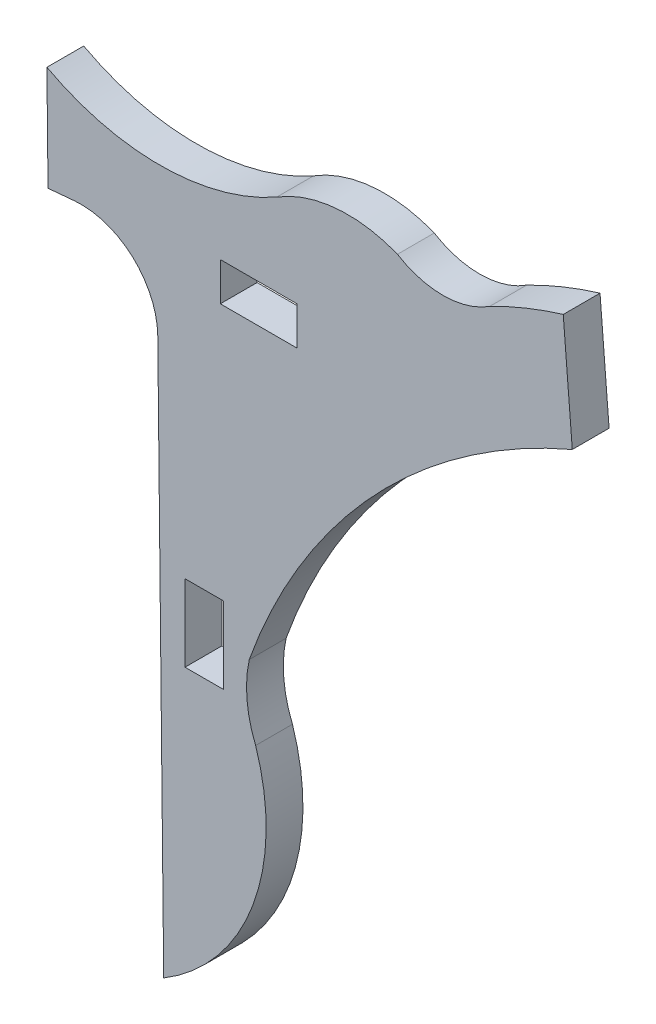
ISO-10303-21;
HEADER;
FILE_DESCRIPTION(('STEP AP214'),'2;1');
FILE_NAME('part.step','',(''),(''),'','','');
FILE_SCHEMA(('AUTOMOTIVE_DESIGN { 1 0 10303 214 1 1 1 1 }'));
ENDSEC;
DATA;
#1=APPLICATION_CONTEXT('core data for automotive mechanical design processes');
#2=APPLICATION_PROTOCOL_DEFINITION('international standard','automotive_design',2000,#1);
#3=PRODUCT_CONTEXT('',#1,'mechanical');
#4=PRODUCT('Part','Part','',(#3));
#5=PRODUCT_RELATED_PRODUCT_CATEGORY('part','',(#4));
#6=PRODUCT_DEFINITION_FORMATION('','',#4);
#7=PRODUCT_DEFINITION_CONTEXT('part definition',#1,'design');
#8=PRODUCT_DEFINITION('design','',#6,#7);
#9=PRODUCT_DEFINITION_SHAPE('','',#8);
#10=(LENGTH_UNIT() NAMED_UNIT(*) SI_UNIT(.MILLI.,.METRE.));
#11=(NAMED_UNIT(*) PLANE_ANGLE_UNIT() SI_UNIT($,.RADIAN.));
#12=(NAMED_UNIT(*) SI_UNIT($,.STERADIAN.) SOLID_ANGLE_UNIT());
#13=UNCERTAINTY_MEASURE_WITH_UNIT(LENGTH_MEASURE(1.E-05),#10,'distance_accuracy_value','');
#14=(GEOMETRIC_REPRESENTATION_CONTEXT(3) GLOBAL_UNCERTAINTY_ASSIGNED_CONTEXT((#13)) GLOBAL_UNIT_ASSIGNED_CONTEXT((#10,
#11,#12)) REPRESENTATION_CONTEXT('',''));
#15=CARTESIAN_POINT('',(0.,0.,0.));
#16=DIRECTION('',(0.,0.,1.));
#17=DIRECTION('',(1.,0.,0.));
#18=AXIS2_PLACEMENT_3D('',#15,#16,#17);
#19=CARTESIAN_POINT('',(0.,51.7881294098823,1.524));
#20=DIRECTION('',(0.,-1.,0.));
#21=DIRECTION('',(0.,0.,-1.));
#22=AXIS2_PLACEMENT_3D('',#19,#20,#21);
#23=PLANE('',#22);
#24=DIRECTION('',(-1.,0.,0.));
#25=VECTOR('',#24,1.);
#26=CARTESIAN_POINT('',(0.,51.7881294098823,0.));
#27=LINE('',#26,#25);
#28=CARTESIAN_POINT('',(-93.5356901838483,51.7881294098823,0.));
#29=VERTEX_POINT('',#28);
#30=CARTESIAN_POINT('',(-95.1231901838483,51.7881294098823,0.));
#31=VERTEX_POINT('',#30);
#32=EDGE_CURVE('E249',#29,#31,#27,.T.);
#33=ORIENTED_EDGE('',*,*,#32,.T.);
#34=DIRECTION('',(0.,0.,-1.));
#35=VECTOR('',#34,1.);
#36=CARTESIAN_POINT('',(-95.1231901838483,51.7881294098823,1.524));
#37=LINE('',#36,#35);
#38=CARTESIAN_POINT('',(-95.1231901838483,51.7881294098823,1.524));
#39=VERTEX_POINT('',#38);
#40=EDGE_CURVE('E11',#39,#31,#37,.T.);
#41=ORIENTED_EDGE('',*,*,#40,.F.);
#42=DIRECTION('',(-1.,0.,0.));
#43=VECTOR('',#42,1.);
#44=CARTESIAN_POINT('',(0.,51.7881294098823,1.524));
#45=LINE('',#44,#43);
#46=CARTESIAN_POINT('',(-93.5356901838483,51.7881294098823,1.524));
#47=VERTEX_POINT('',#46);
#48=EDGE_CURVE('E187',#47,#39,#45,.T.);
#49=ORIENTED_EDGE('',*,*,#48,.F.);
#50=DIRECTION('',(0.,0.,-1.));
#51=VECTOR('',#50,1.);
#52=CARTESIAN_POINT('',(-93.5356901838483,51.7881294098823,1.524));
#53=LINE('',#52,#51);
#54=EDGE_CURVE('E256',#47,#29,#53,.T.);
#55=ORIENTED_EDGE('',*,*,#54,.T.);
#56=EDGE_LOOP('',(#33,#41,#49,#55));
#57=FACE_BOUND('',#56,.T.);
#58=ADVANCED_FACE('F34',(#57),#23,.F.);
#59=CARTESIAN_POINT('',(-95.1231901838485,4.15779354007507E-13,1.524));
#60=DIRECTION('',(-1.,0.,0.));
#61=DIRECTION('',(0.,-1.,0.));
#62=AXIS2_PLACEMENT_3D('',#59,#60,#61);
#63=PLANE('',#62);
#64=DIRECTION('',(0.,1.,0.));
#65=VECTOR('',#64,1.);
#66=CARTESIAN_POINT('',(-95.1231901838485,4.15779354007507E-13,0.));
#67=LINE('',#66,#65);
#68=CARTESIAN_POINT('',(-95.1231901838483,54.9631294098823,0.));
#69=VERTEX_POINT('',#68);
#70=EDGE_CURVE('E192',#31,#69,#67,.T.);
#71=ORIENTED_EDGE('',*,*,#70,.T.);
#72=DIRECTION('',(0.,0.,-1.));
#73=VECTOR('',#72,1.);
#74=CARTESIAN_POINT('',(-95.1231901838483,54.9631294098823,1.524));
#75=LINE('',#74,#73);
#76=CARTESIAN_POINT('',(-95.1231901838483,54.9631294098823,1.524));
#77=VERTEX_POINT('',#76);
#78=EDGE_CURVE('E44',#77,#69,#75,.T.);
#79=ORIENTED_EDGE('',*,*,#78,.F.);
#80=DIRECTION('',(0.,1.,0.));
#81=VECTOR('',#80,1.);
#82=CARTESIAN_POINT('',(-95.1231901838485,4.15779354007507E-13,1.524));
#83=LINE('',#82,#81);
#84=EDGE_CURVE('E181',#39,#77,#83,.T.);
#85=ORIENTED_EDGE('',*,*,#84,.F.);
#86=ORIENTED_EDGE('',*,*,#40,.T.);
#87=EDGE_LOOP('',(#71,#79,#85,#86));
#88=FACE_BOUND('',#87,.T.);
#89=ADVANCED_FACE('F191',(#88),#63,.F.);
#90=CARTESIAN_POINT('',(0.,54.9631294098823,1.524));
#91=DIRECTION('',(0.,1.,0.));
#92=DIRECTION('',(0.,0.,1.));
#93=AXIS2_PLACEMENT_3D('',#90,#91,#92);
#94=PLANE('',#93);
#95=DIRECTION('',(1.,0.,0.));
#96=VECTOR('',#95,1.);
#97=CARTESIAN_POINT('',(0.,54.9631294098823,0.));
#98=LINE('',#97,#96);
#99=CARTESIAN_POINT('',(-93.5356901838483,54.9631294098823,0.));
#100=VERTEX_POINT('',#99);
#101=EDGE_CURVE('E118',#69,#100,#98,.T.);
#102=ORIENTED_EDGE('',*,*,#101,.T.);
#103=DIRECTION('',(0.,0.,-1.));
#104=VECTOR('',#103,1.);
#105=CARTESIAN_POINT('',(-93.5356901838483,54.9631294098823,1.524));
#106=LINE('',#105,#104);
#107=CARTESIAN_POINT('',(-93.5356901838483,54.9631294098823,1.524));
#108=VERTEX_POINT('',#107);
#109=EDGE_CURVE('E193',#108,#100,#106,.T.);
#110=ORIENTED_EDGE('',*,*,#109,.F.);
#111=DIRECTION('',(1.,0.,0.));
#112=VECTOR('',#111,1.);
#113=CARTESIAN_POINT('',(0.,54.9631294098823,1.524));
#114=LINE('',#113,#112);
#115=EDGE_CURVE('E185',#77,#108,#114,.T.);
#116=ORIENTED_EDGE('',*,*,#115,.F.);
#117=ORIENTED_EDGE('',*,*,#78,.T.);
#118=EDGE_LOOP('',(#102,#110,#116,#117));
#119=FACE_BOUND('',#118,.T.);
#120=ADVANCED_FACE('F195',(#119),#94,.F.);
#121=CARTESIAN_POINT('',(0.,65.550965331908,1.524));
#122=DIRECTION('',(0.,1.,0.));
#123=DIRECTION('',(0.,0.,1.));
#124=AXIS2_PLACEMENT_3D('',#121,#122,#123);
#125=PLANE('',#124);
#126=DIRECTION('',(1.,0.,0.));
#127=VECTOR('',#126,1.);
#128=CARTESIAN_POINT('',(0.,65.550965331908,0.));
#129=LINE('',#128,#127);
#130=CARTESIAN_POINT('',(-93.6606975148635,65.550965331908,0.));
#131=VERTEX_POINT('',#130);
#132=CARTESIAN_POINT('',(-90.4856975148635,65.550965331908,0.));
#133=VERTEX_POINT('',#132);
#134=EDGE_CURVE('E237',#131,#133,#129,.T.);
#135=ORIENTED_EDGE('',*,*,#134,.F.);
#136=DIRECTION('',(0.,0.,-1.));
#137=VECTOR('',#136,1.);
#138=CARTESIAN_POINT('',(-93.6606975148635,65.550965331908,1.524));
#139=LINE('',#138,#137);
#140=CARTESIAN_POINT('',(-93.6606975148635,65.550965331908,1.524));
#141=VERTEX_POINT('',#140);
#142=EDGE_CURVE('E258',#141,#131,#139,.T.);
#143=ORIENTED_EDGE('',*,*,#142,.F.);
#144=DIRECTION('',(1.,0.,0.));
#145=VECTOR('',#144,1.);
#146=CARTESIAN_POINT('',(0.,65.550965331908,1.524));
#147=LINE('',#146,#145);
#148=CARTESIAN_POINT('',(-90.4856975148635,65.550965331908,1.524));
#149=VERTEX_POINT('',#148);
#150=EDGE_CURVE('E339',#141,#149,#147,.T.);
#151=ORIENTED_EDGE('',*,*,#150,.T.);
#152=DIRECTION('',(0.,0.,-1.));
#153=VECTOR('',#152,1.);
#154=CARTESIAN_POINT('',(-90.4856975148635,65.550965331908,1.524));
#155=LINE('',#154,#153);
#156=EDGE_CURVE('E260',#149,#133,#155,.T.);
#157=ORIENTED_EDGE('',*,*,#156,.T.);
#158=EDGE_LOOP('',(#135,#143,#151,#157));
#159=FACE_BOUND('',#158,.T.);
#160=ADVANCED_FACE('F364',(#159),#125,.T.);
#161=CARTESIAN_POINT('',(-93.6606975148641,8.18773723491756E-13,1.524));
#162=DIRECTION('',(1.,0.,0.));
#163=DIRECTION('',(0.,1.,0.));
#164=AXIS2_PLACEMENT_3D('',#161,#162,#163);
#165=PLANE('',#164);
#166=DIRECTION('',(0.,-1.,0.));
#167=VECTOR('',#166,1.);
#168=CARTESIAN_POINT('',(-93.6606975148641,8.18773723491756E-13,0.));
#169=LINE('',#168,#167);
#170=CARTESIAN_POINT('',(-93.6606975148635,67.138465331908,0.));
#171=VERTEX_POINT('',#170);
#172=EDGE_CURVE('E240',#171,#131,#169,.T.);
#173=ORIENTED_EDGE('',*,*,#172,.F.);
#174=DIRECTION('',(0.,0.,-1.));
#175=VECTOR('',#174,1.);
#176=CARTESIAN_POINT('',(-93.6606975148635,67.138465331908,1.524));
#177=LINE('',#176,#175);
#178=CARTESIAN_POINT('',(-93.6606975148635,67.138465331908,1.524));
#179=VERTEX_POINT('',#178);
#180=EDGE_CURVE('E264',#179,#171,#177,.T.);
#181=ORIENTED_EDGE('',*,*,#180,.F.);
#182=DIRECTION('',(0.,-1.,0.));
#183=VECTOR('',#182,1.);
#184=CARTESIAN_POINT('',(-93.6606975148641,8.18773723491756E-13,1.524));
#185=LINE('',#184,#183);
#186=EDGE_CURVE('E342',#179,#141,#185,.T.);
#187=ORIENTED_EDGE('',*,*,#186,.T.);
#188=ORIENTED_EDGE('',*,*,#142,.T.);
#189=EDGE_LOOP('',(#173,#181,#187,#188));
#190=FACE_BOUND('',#189,.T.);
#191=ADVANCED_FACE('F366',(#190),#165,.T.);
#192=CARTESIAN_POINT('',(0.,67.138465331908,1.524));
#193=DIRECTION('',(0.,-1.,0.));
#194=DIRECTION('',(0.,0.,-1.));
#195=AXIS2_PLACEMENT_3D('',#192,#193,#194);
#196=PLANE('',#195);
#197=DIRECTION('',(-1.,0.,0.));
#198=VECTOR('',#197,1.);
#199=CARTESIAN_POINT('',(0.,67.138465331908,0.));
#200=LINE('',#199,#198);
#201=CARTESIAN_POINT('',(-90.4856975148635,67.138465331908,0.));
#202=VERTEX_POINT('',#201);
#203=EDGE_CURVE('E243',#202,#171,#200,.T.);
#204=ORIENTED_EDGE('',*,*,#203,.F.);
#205=DIRECTION('',(0.,0.,-1.));
#206=VECTOR('',#205,1.);
#207=CARTESIAN_POINT('',(-90.4856975148635,67.138465331908,1.524));
#208=LINE('',#207,#206);
#209=CARTESIAN_POINT('',(-90.4856975148635,67.138465331908,1.524));
#210=VERTEX_POINT('',#209);
#211=EDGE_CURVE('E262',#210,#202,#208,.T.);
#212=ORIENTED_EDGE('',*,*,#211,.F.);
#213=DIRECTION('',(-1.,0.,0.));
#214=VECTOR('',#213,1.);
#215=CARTESIAN_POINT('',(0.,67.138465331908,1.524));
#216=LINE('',#215,#214);
#217=EDGE_CURVE('E345',#210,#179,#216,.T.);
#218=ORIENTED_EDGE('',*,*,#217,.T.);
#219=ORIENTED_EDGE('',*,*,#180,.T.);
#220=EDGE_LOOP('',(#204,#212,#218,#219));
#221=FACE_BOUND('',#220,.T.);
#222=ADVANCED_FACE('F359',(#221),#196,.T.);
#223=CARTESIAN_POINT('',(-100.533781239061,47.7146855529903,1.524));
#224=DIRECTION('',(0.,0.,-1.));
#225=DIRECTION('',(-1.,0.,0.));
#226=AXIS2_PLACEMENT_3D('',#223,#224,#225);
#227=CYLINDRICAL_SURFACE('',#226,8.77123162975134);
#228=CARTESIAN_POINT('',(-100.533781239061,47.7146855529903,0.));
#229=DIRECTION('',(0.,0.,1.));
#230=DIRECTION('',(1.,0.,0.));
#231=AXIS2_PLACEMENT_3D('',#228,#229,#230);
#232=CIRCLE('',#231,8.77123162975134);
#233=CARTESIAN_POINT('',(-92.1980997808279,50.4443226954718,0.));
#234=VERTEX_POINT('',#233);
#235=CARTESIAN_POINT('',(-96.0040201815849,40.2036424120597,0.));
#236=VERTEX_POINT('',#235);
#237=EDGE_CURVE('E201',#234,#236,#232,.F.);
#238=ORIENTED_EDGE('',*,*,#237,.F.);
#239=DIRECTION('',(0.,0.,-1.));
#240=VECTOR('',#239,1.);
#241=CARTESIAN_POINT('',(-92.1980997808279,50.4443226954718,1.524));
#242=LINE('',#241,#240);
#243=CARTESIAN_POINT('',(-92.1980997808279,50.4443226954718,1.524));
#244=VERTEX_POINT('',#243);
#245=EDGE_CURVE('E38',#244,#234,#242,.T.);
#246=ORIENTED_EDGE('',*,*,#245,.F.);
#247=CARTESIAN_POINT('',(-100.533781239061,47.7146855529903,1.524));
#248=DIRECTION('',(0.,0.,1.));
#249=DIRECTION('',(1.,0.,0.));
#250=AXIS2_PLACEMENT_3D('',#247,#248,#249);
#251=CIRCLE('',#250,8.77123162975134);
#252=CARTESIAN_POINT('',(-96.0040201815849,40.2036424120597,1.524));
#253=VERTEX_POINT('',#252);
#254=EDGE_CURVE('E255',#244,#253,#251,.F.);
#255=ORIENTED_EDGE('',*,*,#254,.T.);
#256=DIRECTION('',(0.,0.,-1.));
#257=VECTOR('',#256,1.);
#258=CARTESIAN_POINT('',(-96.0040201815849,40.2036424120597,1.524));
#259=LINE('',#258,#257);
#260=EDGE_CURVE('E197',#253,#236,#259,.T.);
#261=ORIENTED_EDGE('',*,*,#260,.T.);
#262=EDGE_LOOP('',(#238,#246,#255,#261));
#263=FACE_BOUND('',#262,.T.);
#264=ADVANCED_FACE('F36',(#263),#227,.T.);
#265=CARTESIAN_POINT('',(-87.625215276845,52.3406668797845,1.524));
#266=DIRECTION('',(0.,0.,-1.));
#267=DIRECTION('',(-1.,0.,0.));
#268=AXIS2_PLACEMENT_3D('',#265,#266,#267);
#269=CYLINDRICAL_SURFACE('',#268,4.95049431391898);
#270=CARTESIAN_POINT('',(-87.625215276845,52.3406668797845,0.));
#271=DIRECTION('',(0.,0.,1.));
#272=DIRECTION('',(1.,0.,0.));
#273=AXIS2_PLACEMENT_3D('',#270,#271,#272);
#274=CIRCLE('',#273,4.95049431391898);
#275=CARTESIAN_POINT('',(-92.4625942444375,53.3928829583699,0.));
#276=VERTEX_POINT('',#275);
#277=EDGE_CURVE('E204',#276,#234,#274,.T.);
#278=ORIENTED_EDGE('',*,*,#277,.F.);
#279=DIRECTION('',(0.,0.,-1.));
#280=VECTOR('',#279,1.);
#281=CARTESIAN_POINT('',(-92.4625942444375,53.3928829583699,1.524));
#282=LINE('',#281,#280);
#283=CARTESIAN_POINT('',(-92.4625942444375,53.3928829583699,1.524));
#284=VERTEX_POINT('',#283);
#285=EDGE_CURVE('E285',#284,#276,#282,.T.);
#286=ORIENTED_EDGE('',*,*,#285,.F.);
#287=CARTESIAN_POINT('',(-87.625215276845,52.3406668797845,1.524));
#288=DIRECTION('',(0.,0.,1.));
#289=DIRECTION('',(1.,0.,0.));
#290=AXIS2_PLACEMENT_3D('',#287,#288,#289);
#291=CIRCLE('',#290,4.95049431391898);
#292=EDGE_CURVE('E294',#284,#244,#291,.T.);
#293=ORIENTED_EDGE('',*,*,#292,.T.);
#294=ORIENTED_EDGE('',*,*,#245,.T.);
#295=EDGE_LOOP('',(#278,#286,#293,#294));
#296=FACE_BOUND('',#295,.T.);
#297=ADVANCED_FACE('F292',(#296),#269,.F.);
#298=CARTESIAN_POINT('',(-69.4917523303344,45.1872253676361,1.524));
#299=DIRECTION('',(0.,0.,-1.));
#300=DIRECTION('',(-1.,0.,0.));
#301=AXIS2_PLACEMENT_3D('',#298,#299,#300);
#302=CYLINDRICAL_SURFACE('',#301,24.3924659421527);
#303=CARTESIAN_POINT('',(-69.4917523303344,45.1872253676361,0.));
#304=DIRECTION('',(0.,0.,1.));
#305=DIRECTION('',(1.,0.,0.));
#306=AXIS2_PLACEMENT_3D('',#303,#304,#305);
#307=CIRCLE('',#306,24.3924659421527);
#308=CARTESIAN_POINT('',(-79.0869607827931,67.6132006974388,0.));
#309=VERTEX_POINT('',#308);
#310=EDGE_CURVE('E207',#309,#276,#307,.T.);
#311=ORIENTED_EDGE('',*,*,#310,.F.);
#312=DIRECTION('',(0.,0.,-1.));
#313=VECTOR('',#312,1.);
#314=CARTESIAN_POINT('',(-79.0869607827931,67.6132006974388,1.524));
#315=LINE('',#314,#313);
#316=CARTESIAN_POINT('',(-79.0869607827931,67.6132006974388,1.524));
#317=VERTEX_POINT('',#316);
#318=EDGE_CURVE('E284',#317,#309,#315,.T.);
#319=ORIENTED_EDGE('',*,*,#318,.F.);
#320=CARTESIAN_POINT('',(-69.4917523303344,45.1872253676361,1.524));
#321=DIRECTION('',(0.,0.,1.));
#322=DIRECTION('',(1.,0.,0.));
#323=AXIS2_PLACEMENT_3D('',#320,#321,#322);
#324=CIRCLE('',#323,24.3924659421527);
#325=EDGE_CURVE('E303',#317,#284,#324,.T.);
#326=ORIENTED_EDGE('',*,*,#325,.T.);
#327=ORIENTED_EDGE('',*,*,#285,.T.);
#328=EDGE_LOOP('',(#311,#319,#326,#327));
#329=FACE_BOUND('',#328,.T.);
#330=ADVANCED_FACE('F300',(#329),#302,.F.);
#331=CARTESIAN_POINT('',(-73.1683422539405,-5.89153226891945,1.524));
#332=DIRECTION('',(-0.996773924473984,-0.080260472766686,0.));
#333=DIRECTION('',(0.080260472766686,-0.996773924473984,0.));
#334=AXIS2_PLACEMENT_3D('',#331,#332,#333);
#335=PLANE('',#334);
#336=DIRECTION('',(-0.080260472766686,0.996773924473984,0.));
#337=VECTOR('',#336,1.);
#338=CARTESIAN_POINT('',(-73.1683422539405,-5.89153226891945,0.));
#339=LINE('',#338,#337);
#340=CARTESIAN_POINT('',(-79.4618776474777,72.269382522451,0.));
#341=VERTEX_POINT('',#340);
#342=EDGE_CURVE('E210',#309,#341,#339,.T.);
#343=ORIENTED_EDGE('',*,*,#342,.T.);
#344=DIRECTION('',(0.,0.,-1.));
#345=VECTOR('',#344,1.);
#346=CARTESIAN_POINT('',(-79.4618776474777,72.269382522451,1.524));
#347=LINE('',#346,#345);
#348=CARTESIAN_POINT('',(-79.4618776474777,72.269382522451,1.524));
#349=VERTEX_POINT('',#348);
#350=EDGE_CURVE('E282',#349,#341,#347,.T.);
#351=ORIENTED_EDGE('',*,*,#350,.F.);
#352=DIRECTION('',(-0.080260472766686,0.996773924473984,0.));
#353=VECTOR('',#352,1.);
#354=CARTESIAN_POINT('',(-73.1683422539405,-5.89153226891945,1.524));
#355=LINE('',#354,#353);
#356=EDGE_CURVE('E306',#317,#349,#355,.T.);
#357=ORIENTED_EDGE('',*,*,#356,.F.);
#358=ORIENTED_EDGE('',*,*,#318,.T.);
#359=EDGE_LOOP('',(#343,#351,#357,#358));
#360=FACE_BOUND('',#359,.T.);
#361=ADVANCED_FACE('F307',(#360),#335,.F.);
#362=CARTESIAN_POINT('',(-74.2276944907188,54.9842202301837,1.524));
#363=DIRECTION('',(0.,0.,-1.));
#364=DIRECTION('',(-1.,0.,0.));
#365=AXIS2_PLACEMENT_3D('',#362,#363,#364);
#366=CYLINDRICAL_SURFACE('',#365,18.0602743276102);
#367=CARTESIAN_POINT('',(-74.2276944907188,54.9842202301837,0.));
#368=DIRECTION('',(0.,0.,1.));
#369=DIRECTION('',(1.,0.,0.));
#370=AXIS2_PLACEMENT_3D('',#367,#368,#369);
#371=CIRCLE('',#370,18.0602743276102);
#372=CARTESIAN_POINT('',(-82.5033543901141,71.0368512300571,0.));
#373=VERTEX_POINT('',#372);
#374=EDGE_CURVE('E213',#373,#341,#371,.F.);
#375=ORIENTED_EDGE('',*,*,#374,.F.);
#376=DIRECTION('',(0.,0.,-1.));
#377=VECTOR('',#376,1.);
#378=CARTESIAN_POINT('',(-82.5033543901141,71.0368512300571,1.524));
#379=LINE('',#378,#377);
#380=CARTESIAN_POINT('',(-82.5033543901141,71.0368512300571,1.524));
#381=VERTEX_POINT('',#380);
#382=EDGE_CURVE('E280',#381,#373,#379,.T.);
#383=ORIENTED_EDGE('',*,*,#382,.F.);
#384=CARTESIAN_POINT('',(-74.2276944907188,54.9842202301837,1.524));
#385=DIRECTION('',(0.,0.,1.));
#386=DIRECTION('',(1.,0.,0.));
#387=AXIS2_PLACEMENT_3D('',#384,#385,#386);
#388=CIRCLE('',#387,18.0602743276102);
#389=EDGE_CURVE('E311',#381,#349,#388,.F.);
#390=ORIENTED_EDGE('',*,*,#389,.T.);
#391=ORIENTED_EDGE('',*,*,#350,.T.);
#392=EDGE_LOOP('',(#375,#383,#390,#391));
#393=FACE_BOUND('',#392,.T.);
#394=ADVANCED_FACE('F418',(#393),#366,.T.);
#395=CARTESIAN_POINT('',(-84.4466771001624,74.0347247771991,1.524));
#396=DIRECTION('',(0.,0.,-1.));
#397=DIRECTION('',(-1.,0.,0.));
#398=AXIS2_PLACEMENT_3D('',#395,#396,#397);
#399=CYLINDRICAL_SURFACE('',#398,3.57263893502314);
#400=CARTESIAN_POINT('',(-84.4466771001624,74.0347247771991,0.));
#401=DIRECTION('',(0.,0.,1.));
#402=DIRECTION('',(1.,0.,0.));
#403=AXIS2_PLACEMENT_3D('',#400,#401,#402);
#404=CIRCLE('',#403,3.57263893502314);
#405=CARTESIAN_POINT('',(-86.3252410207497,70.9958521973909,0.));
#406=VERTEX_POINT('',#405);
#407=EDGE_CURVE('E216',#406,#373,#404,.T.);
#408=ORIENTED_EDGE('',*,*,#407,.F.);
#409=DIRECTION('',(0.,0.,-1.));
#410=VECTOR('',#409,1.);
#411=CARTESIAN_POINT('',(-86.3252410207497,70.9958521973909,1.524));
#412=LINE('',#411,#410);
#413=CARTESIAN_POINT('',(-86.3252410207497,70.9958521973909,1.524));
#414=VERTEX_POINT('',#413);
#415=EDGE_CURVE('E278',#414,#406,#412,.T.);
#416=ORIENTED_EDGE('',*,*,#415,.F.);
#417=CARTESIAN_POINT('',(-84.4466771001624,74.0347247771991,1.524));
#418=DIRECTION('',(0.,0.,1.));
#419=DIRECTION('',(1.,0.,0.));
#420=AXIS2_PLACEMENT_3D('',#417,#418,#419);
#421=CIRCLE('',#420,3.57263893502314);
#422=EDGE_CURVE('E319',#414,#381,#421,.T.);
#423=ORIENTED_EDGE('',*,*,#422,.T.);
#424=ORIENTED_EDGE('',*,*,#382,.T.);
#425=EDGE_LOOP('',(#408,#416,#423,#424));
#426=FACE_BOUND('',#425,.T.);
#427=ADVANCED_FACE('F414',(#426),#399,.F.);
#428=CARTESIAN_POINT('',(-88.3823835925569,65.8565425202193,1.524));
#429=DIRECTION('',(0.,0.,-1.));
#430=DIRECTION('',(-1.,0.,0.));
#431=AXIS2_PLACEMENT_3D('',#428,#429,#430);
#432=CYLINDRICAL_SURFACE('',#431,5.53573297031312);
#433=CARTESIAN_POINT('',(-88.3823835925569,65.8565425202193,0.));
#434=DIRECTION('',(0.,0.,1.));
#435=DIRECTION('',(1.,0.,0.));
#436=AXIS2_PLACEMENT_3D('',#433,#434,#435);
#437=CIRCLE('',#436,5.53573297031312);
#438=CARTESIAN_POINT('',(-91.3249965476735,70.5453982990837,0.));
#439=VERTEX_POINT('',#438);
#440=EDGE_CURVE('E219',#439,#406,#437,.F.);
#441=ORIENTED_EDGE('',*,*,#440,.F.);
#442=DIRECTION('',(0.,0.,-1.));
#443=VECTOR('',#442,1.);
#444=CARTESIAN_POINT('',(-91.3249965476735,70.5453982990837,1.524));
#445=LINE('',#444,#443);
#446=CARTESIAN_POINT('',(-91.3249965476735,70.5453982990837,1.524));
#447=VERTEX_POINT('',#446);
#448=EDGE_CURVE('E276',#447,#439,#445,.T.);
#449=ORIENTED_EDGE('',*,*,#448,.F.);
#450=CARTESIAN_POINT('',(-88.3823835925569,65.8565425202193,1.524));
#451=DIRECTION('',(0.,0.,1.));
#452=DIRECTION('',(1.,0.,0.));
#453=AXIS2_PLACEMENT_3D('',#450,#451,#452);
#454=CIRCLE('',#453,5.53573297031312);
#455=EDGE_CURVE('E322',#447,#414,#454,.F.);
#456=ORIENTED_EDGE('',*,*,#455,.T.);
#457=ORIENTED_EDGE('',*,*,#415,.T.);
#458=EDGE_LOOP('',(#441,#449,#456,#457));
#459=FACE_BOUND('',#458,.T.);
#460=ADVANCED_FACE('F410',(#459),#432,.T.);
#461=CARTESIAN_POINT('',(-96.1754451087001,79.1283081167407,1.524));
#462=DIRECTION('',(0.,0.,-1.));
#463=DIRECTION('',(-1.,0.,0.));
#464=AXIS2_PLACEMENT_3D('',#461,#462,#463);
#465=CYLINDRICAL_SURFACE('',#464,9.85866077016533);
#466=CARTESIAN_POINT('',(-96.1754451087001,79.1283081167407,0.));
#467=DIRECTION('',(0.,0.,1.));
#468=DIRECTION('',(1.,0.,0.));
#469=AXIS2_PLACEMENT_3D('',#466,#467,#468);
#470=CIRCLE('',#469,9.85866077016533);
#471=CARTESIAN_POINT('',(-100.840653449104,70.4433197274652,0.));
#472=VERTEX_POINT('',#471);
#473=EDGE_CURVE('E222',#472,#439,#470,.T.);
#474=ORIENTED_EDGE('',*,*,#473,.F.);
#475=DIRECTION('',(0.,0.,-1.));
#476=VECTOR('',#475,1.);
#477=CARTESIAN_POINT('',(-100.840653449104,70.4433197274652,1.524));
#478=LINE('',#477,#476);
#479=CARTESIAN_POINT('',(-100.840653449104,70.4433197274652,1.524));
#480=VERTEX_POINT('',#479);
#481=EDGE_CURVE('E274',#480,#472,#478,.T.);
#482=ORIENTED_EDGE('',*,*,#481,.F.);
#483=CARTESIAN_POINT('',(-96.1754451087001,79.1283081167407,1.524));
#484=DIRECTION('',(0.,0.,1.));
#485=DIRECTION('',(1.,0.,0.));
#486=AXIS2_PLACEMENT_3D('',#483,#484,#485);
#487=CIRCLE('',#486,9.85866077016533);
#488=EDGE_CURVE('E325',#480,#447,#487,.T.);
#489=ORIENTED_EDGE('',*,*,#488,.T.);
#490=ORIENTED_EDGE('',*,*,#448,.T.);
#491=EDGE_LOOP('',(#474,#482,#489,#490));
#492=FACE_BOUND('',#491,.T.);
#493=ADVANCED_FACE('F406',(#492),#465,.F.);
#494=CARTESIAN_POINT('',(-100.073461222641,-1.07353134780039,1.524));
#495=DIRECTION('',(-0.999942466056501,-0.0107268157830602,0.));
#496=DIRECTION('',(0.0107268157830602,-0.999942466056501,0.));
#497=AXIS2_PLACEMENT_3D('',#494,#495,#496);
#498=PLANE('',#497);
#499=DIRECTION('',(-0.0107268157830602,0.999942466056501,0.));
#500=VECTOR('',#499,1.);
#501=CARTESIAN_POINT('',(-100.073461222641,-1.07353134780039,0.));
#502=LINE('',#501,#500);
#503=CARTESIAN_POINT('',(-100.794339098052,66.1259447168864,0.));
#504=VERTEX_POINT('',#503);
#505=EDGE_CURVE('E225',#504,#472,#502,.T.);
#506=ORIENTED_EDGE('',*,*,#505,.F.);
#507=DIRECTION('',(0.,0.,-1.));
#508=VECTOR('',#507,1.);
#509=CARTESIAN_POINT('',(-100.794339098052,66.1259447168864,1.524));
#510=LINE('',#509,#508);
#511=CARTESIAN_POINT('',(-100.794339098052,66.1259447168864,1.524));
#512=VERTEX_POINT('',#511);
#513=EDGE_CURVE('E272',#512,#504,#510,.T.);
#514=ORIENTED_EDGE('',*,*,#513,.F.);
#515=DIRECTION('',(-0.0107268157830602,0.999942466056501,0.));
#516=VECTOR('',#515,1.);
#517=CARTESIAN_POINT('',(-100.073461222641,-1.07353134780039,1.524));
#518=LINE('',#517,#516);
#519=EDGE_CURVE('E328',#512,#480,#518,.T.);
#520=ORIENTED_EDGE('',*,*,#519,.T.);
#521=ORIENTED_EDGE('',*,*,#481,.T.);
#522=EDGE_LOOP('',(#506,#514,#520,#521));
#523=FACE_BOUND('',#522,.T.);
#524=ADVANCED_FACE('F400',(#523),#498,.T.);
#525=CARTESIAN_POINT('',(-6.74853557784505,74.6301660594656,1.524));
#526=DIRECTION('',(0.0900589244987042,-0.995936438794232,0.));
#527=DIRECTION('',(0.995936438794232,0.0900589244987042,0.));
#528=AXIS2_PLACEMENT_3D('',#525,#526,#527);
#529=PLANE('',#528);
#530=DIRECTION('',(-0.995936438794232,-0.0900589244987042,0.));
#531=VECTOR('',#530,1.);
#532=CARTESIAN_POINT('',(-6.74853557784505,74.6301660594656,0.));
#533=LINE('',#532,#531);
#534=CARTESIAN_POINT('',(-99.7103500276516,66.223965921901,0.));
#535=VERTEX_POINT('',#534);
#536=EDGE_CURVE('E228',#535,#504,#533,.T.);
#537=ORIENTED_EDGE('',*,*,#536,.F.);
#538=DIRECTION('',(0.,0.,-1.));
#539=VECTOR('',#538,1.);
#540=CARTESIAN_POINT('',(-99.7103500276516,66.223965921901,1.524));
#541=LINE('',#540,#539);
#542=CARTESIAN_POINT('',(-99.7103500276516,66.223965921901,1.524));
#543=VERTEX_POINT('',#542);
#544=EDGE_CURVE('E270',#543,#535,#541,.T.);
#545=ORIENTED_EDGE('',*,*,#544,.F.);
#546=DIRECTION('',(-0.995936438794232,-0.0900589244987042,0.));
#547=VECTOR('',#546,1.);
#548=CARTESIAN_POINT('',(-6.74853557784505,74.6301660594656,1.524));
#549=LINE('',#548,#547);
#550=EDGE_CURVE('E331',#543,#512,#549,.T.);
#551=ORIENTED_EDGE('',*,*,#550,.T.);
#552=ORIENTED_EDGE('',*,*,#513,.T.);
#553=EDGE_LOOP('',(#537,#545,#551,#552));
#554=FACE_BOUND('',#553,.T.);
#555=ADVANCED_FACE('F394',(#554),#529,.T.);
#556=CARTESIAN_POINT('',(-99.4244129423684,63.0618677287293,1.524));
#557=DIRECTION('',(0.,0.,-1.));
#558=DIRECTION('',(-1.,0.,0.));
#559=AXIS2_PLACEMENT_3D('',#556,#557,#558);
#560=CYLINDRICAL_SURFACE('',#559,3.17500000000003);
#561=CARTESIAN_POINT('',(-99.4244129423684,63.0618677287293,0.));
#562=DIRECTION('',(0.,0.,1.));
#563=DIRECTION('',(1.,0.,0.));
#564=AXIS2_PLACEMENT_3D('',#561,#562,#563);
#565=CIRCLE('',#564,3.17500000000003);
#566=CARTESIAN_POINT('',(-96.249595612639,63.0959253688405,0.));
#567=VERTEX_POINT('',#566);
#568=EDGE_CURVE('E231',#535,#567,#565,.F.);
#569=ORIENTED_EDGE('',*,*,#568,.T.);
#570=DIRECTION('',(0.,0.,-1.));
#571=VECTOR('',#570,1.);
#572=CARTESIAN_POINT('',(-96.249595612639,63.0959253688405,1.524));
#573=LINE('',#572,#571);
#574=CARTESIAN_POINT('',(-96.249595612639,63.0959253688405,1.524));
#575=VERTEX_POINT('',#574);
#576=EDGE_CURVE('E268',#575,#567,#573,.T.);
#577=ORIENTED_EDGE('',*,*,#576,.F.);
#578=CARTESIAN_POINT('',(-99.4244129423684,63.0618677287293,1.524));
#579=DIRECTION('',(0.,0.,1.));
#580=DIRECTION('',(1.,0.,0.));
#581=AXIS2_PLACEMENT_3D('',#578,#579,#580);
#582=CIRCLE('',#581,3.17500000000003);
#583=EDGE_CURVE('E334',#543,#575,#582,.F.);
#584=ORIENTED_EDGE('',*,*,#583,.F.);
#585=ORIENTED_EDGE('',*,*,#544,.T.);
#586=EDGE_LOOP('',(#569,#577,#584,#585));
#587=FACE_BOUND('',#586,.T.);
#588=ADVANCED_FACE('F386',(#587),#560,.F.);
#589=CARTESIAN_POINT('',(-90.4856975148641,7.91018147876127E-13,1.524));
#590=DIRECTION('',(-1.,0.,0.));
#591=DIRECTION('',(0.,-1.,0.));
#592=AXIS2_PLACEMENT_3D('',#589,#590,#591);
#593=PLANE('',#592);
#594=DIRECTION('',(0.,1.,0.));
#595=VECTOR('',#594,1.);
#596=CARTESIAN_POINT('',(-90.4856975148641,7.91018147876127E-13,0.));
#597=LINE('',#596,#595);
#598=EDGE_CURVE('E246',#133,#202,#597,.T.);
#599=ORIENTED_EDGE('',*,*,#598,.F.);
#600=ORIENTED_EDGE('',*,*,#156,.F.);
#601=DIRECTION('',(0.,1.,0.));
#602=VECTOR('',#601,1.);
#603=CARTESIAN_POINT('',(-90.4856975148641,7.91018147876127E-13,1.524));
#604=LINE('',#603,#602);
#605=EDGE_CURVE('E348',#149,#210,#604,.T.);
#606=ORIENTED_EDGE('',*,*,#605,.T.);
#607=ORIENTED_EDGE('',*,*,#211,.T.);
#608=EDGE_LOOP('',(#599,#600,#606,#607));
#609=FACE_BOUND('',#608,.T.);
#610=ADVANCED_FACE('F353',(#609),#593,.T.);
#611=CARTESIAN_POINT('',(-95.5617412655849,-1.02513217436105,1.524));
#612=DIRECTION('',(-0.999942466056501,-0.0107268157830608,0.));
#613=DIRECTION('',(0.0107268157830608,-0.999942466056501,0.));
#614=AXIS2_PLACEMENT_3D('',#611,#612,#613);
#615=PLANE('',#614);
#616=DIRECTION('',(-0.0107268157830608,0.999942466056501,0.));
#617=VECTOR('',#616,1.);
#618=CARTESIAN_POINT('',(-95.5617412655849,-1.02513217436105,0.));
#619=LINE('',#618,#617);
#620=EDGE_CURVE('E234',#236,#567,#619,.T.);
#621=ORIENTED_EDGE('',*,*,#620,.F.);
#622=ORIENTED_EDGE('',*,*,#260,.F.);
#623=DIRECTION('',(-0.0107268157830608,0.999942466056501,0.));
#624=VECTOR('',#623,1.);
#625=CARTESIAN_POINT('',(-95.5617412655849,-1.02513217436105,1.524));
#626=LINE('',#625,#624);
#627=EDGE_CURVE('E336',#253,#575,#626,.T.);
#628=ORIENTED_EDGE('',*,*,#627,.T.);
#629=ORIENTED_EDGE('',*,*,#576,.T.);
#630=EDGE_LOOP('',(#621,#622,#628,#629));
#631=FACE_BOUND('',#630,.T.);
#632=ADVANCED_FACE('F385',(#631),#615,.T.);
#633=CARTESIAN_POINT('',(-93.5356901838483,0.,1.524));
#634=DIRECTION('',(1.,0.,0.));
#635=DIRECTION('',(0.,0.,-1.));
#636=AXIS2_PLACEMENT_3D('',#633,#634,#635);
#637=PLANE('',#636);
#638=DIRECTION('',(0.,-1.,0.));
#639=VECTOR('',#638,1.);
#640=CARTESIAN_POINT('',(-93.5356901838483,0.,0.));
#641=LINE('',#640,#639);
#642=EDGE_CURVE('E124',#100,#29,#641,.T.);
#643=ORIENTED_EDGE('',*,*,#642,.T.);
#644=ORIENTED_EDGE('',*,*,#54,.F.);
#645=DIRECTION('',(0.,-1.,0.));
#646=VECTOR('',#645,1.);
#647=CARTESIAN_POINT('',(-93.5356901838483,0.,1.524));
#648=LINE('',#647,#646);
#649=EDGE_CURVE('E53',#108,#47,#648,.T.);
#650=ORIENTED_EDGE('',*,*,#649,.F.);
#651=ORIENTED_EDGE('',*,*,#109,.T.);
#652=EDGE_LOOP('',(#643,#644,#650,#651));
#653=FACE_BOUND('',#652,.T.);
#654=ADVANCED_FACE('F391',(#653),#637,.F.);
#655=CARTESIAN_POINT('',(0.,0.,1.524));
#656=DIRECTION('',(0.,0.,1.));
#657=DIRECTION('',(1.,0.,0.));
#658=AXIS2_PLACEMENT_3D('',#655,#656,#657);
#659=PLANE('',#658);
#660=ORIENTED_EDGE('',*,*,#254,.F.);
#661=ORIENTED_EDGE('',*,*,#292,.F.);
#662=ORIENTED_EDGE('',*,*,#325,.F.);
#663=ORIENTED_EDGE('',*,*,#356,.T.);
#664=ORIENTED_EDGE('',*,*,#389,.F.);
#665=ORIENTED_EDGE('',*,*,#422,.F.);
#666=ORIENTED_EDGE('',*,*,#455,.F.);
#667=ORIENTED_EDGE('',*,*,#488,.F.);
#668=ORIENTED_EDGE('',*,*,#519,.F.);
#669=ORIENTED_EDGE('',*,*,#550,.F.);
#670=ORIENTED_EDGE('',*,*,#583,.T.);
#671=ORIENTED_EDGE('',*,*,#627,.F.);
#672=EDGE_LOOP('',(#660,#661,#662,#663,#664,#665,#666,#667,#668,#669,#670,#671));
#673=FACE_BOUND('',#672,.T.);
#674=ORIENTED_EDGE('',*,*,#150,.F.);
#675=ORIENTED_EDGE('',*,*,#186,.F.);
#676=ORIENTED_EDGE('',*,*,#217,.F.);
#677=ORIENTED_EDGE('',*,*,#605,.F.);
#678=EDGE_LOOP('',(#674,#675,#676,#677));
#679=FACE_BOUND('',#678,.T.);
#680=ORIENTED_EDGE('',*,*,#48,.T.);
#681=ORIENTED_EDGE('',*,*,#84,.T.);
#682=ORIENTED_EDGE('',*,*,#115,.T.);
#683=ORIENTED_EDGE('',*,*,#649,.T.);
#684=EDGE_LOOP('',(#680,#681,#682,#683));
#685=FACE_BOUND('',#684,.T.);
#686=ADVANCED_FACE('F183',(#673,#679,#685),#659,.T.);
#687=CARTESIAN_POINT('',(0.,0.,0.));
#688=DIRECTION('',(0.,0.,1.));
#689=DIRECTION('',(1.,0.,0.));
#690=AXIS2_PLACEMENT_3D('',#687,#688,#689);
#691=PLANE('',#690);
#692=ORIENTED_EDGE('',*,*,#237,.T.);
#693=ORIENTED_EDGE('',*,*,#620,.T.);
#694=ORIENTED_EDGE('',*,*,#568,.F.);
#695=ORIENTED_EDGE('',*,*,#536,.T.);
#696=ORIENTED_EDGE('',*,*,#505,.T.);
#697=ORIENTED_EDGE('',*,*,#473,.T.);
#698=ORIENTED_EDGE('',*,*,#440,.T.);
#699=ORIENTED_EDGE('',*,*,#407,.T.);
#700=ORIENTED_EDGE('',*,*,#374,.T.);
#701=ORIENTED_EDGE('',*,*,#342,.F.);
#702=ORIENTED_EDGE('',*,*,#310,.T.);
#703=ORIENTED_EDGE('',*,*,#277,.T.);
#704=EDGE_LOOP('',(#692,#693,#694,#695,#696,#697,#698,#699,#700,#701,#702,#703));
#705=FACE_BOUND('',#704,.T.);
#706=ORIENTED_EDGE('',*,*,#134,.T.);
#707=ORIENTED_EDGE('',*,*,#598,.T.);
#708=ORIENTED_EDGE('',*,*,#203,.T.);
#709=ORIENTED_EDGE('',*,*,#172,.T.);
#710=EDGE_LOOP('',(#706,#707,#708,#709));
#711=FACE_BOUND('',#710,.T.);
#712=ORIENTED_EDGE('',*,*,#32,.F.);
#713=ORIENTED_EDGE('',*,*,#642,.F.);
#714=ORIENTED_EDGE('',*,*,#101,.F.);
#715=ORIENTED_EDGE('',*,*,#70,.F.);
#716=EDGE_LOOP('',(#712,#713,#714,#715));
#717=FACE_BOUND('',#716,.T.);
#718=ADVANCED_FACE('F297',(#705,#711,#717),#691,.F.);
#719=CLOSED_SHELL('',(#58,#89,#120,#160,#191,#222,#264,#297,#330,#361,#394,#427,#460,#493,#524,
#555,#588,#610,#632,#654,#686,#718));
#720=MANIFOLD_SOLID_BREP('B2',#719);
#721=ADVANCED_BREP_SHAPE_REPRESENTATION('',(#18,#720),#14);
#722=SHAPE_DEFINITION_REPRESENTATION(#9,#721);
ENDSEC;
END-ISO-10303-21;
